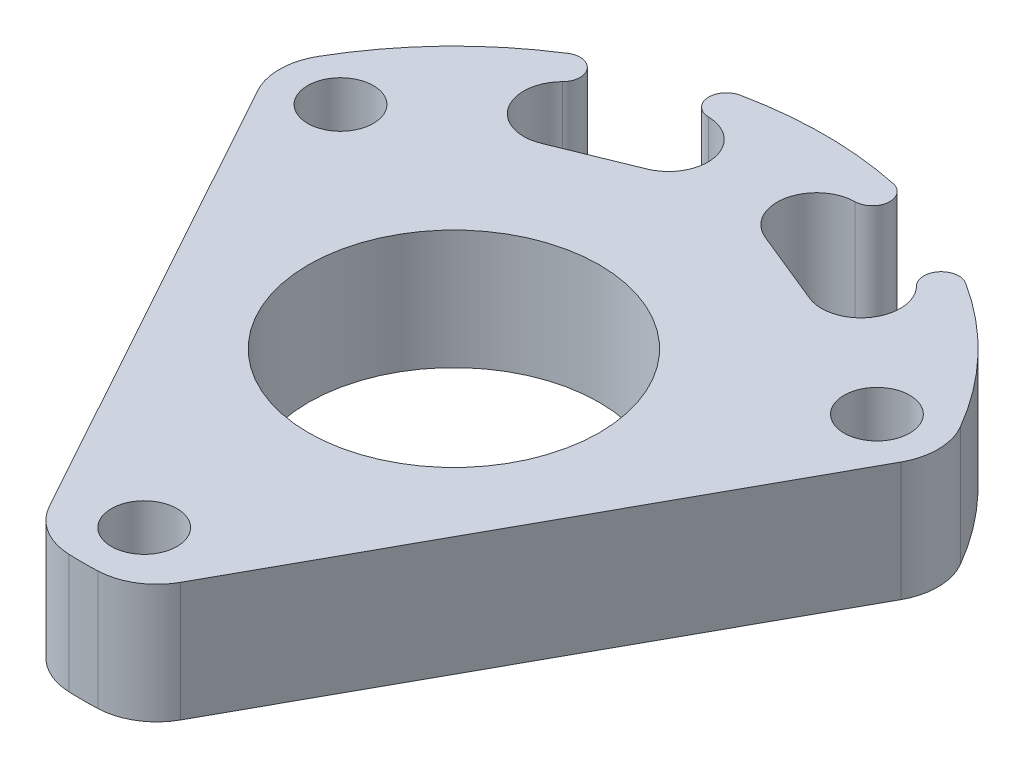
ISO-10303-21;
HEADER;
FILE_DESCRIPTION(('STEP AP214'),'2;1');
FILE_NAME('part.step','',(''),(''),'','','');
FILE_SCHEMA(('AUTOMOTIVE_DESIGN { 1 0 10303 214 1 1 1 1 }'));
ENDSEC;
DATA;
#1=APPLICATION_CONTEXT('core data for automotive mechanical design processes');
#2=APPLICATION_PROTOCOL_DEFINITION('international standard','automotive_design',2000,#1);
#3=PRODUCT_CONTEXT('',#1,'mechanical');
#4=PRODUCT('Part','Part','',(#3));
#5=PRODUCT_RELATED_PRODUCT_CATEGORY('part','',(#4));
#6=PRODUCT_DEFINITION_FORMATION('','',#4);
#7=PRODUCT_DEFINITION_CONTEXT('part definition',#1,'design');
#8=PRODUCT_DEFINITION('design','',#6,#7);
#9=PRODUCT_DEFINITION_SHAPE('','',#8);
#10=(LENGTH_UNIT() NAMED_UNIT(*) SI_UNIT(.MILLI.,.METRE.));
#11=(NAMED_UNIT(*) PLANE_ANGLE_UNIT() SI_UNIT($,.RADIAN.));
#12=(NAMED_UNIT(*) SI_UNIT($,.STERADIAN.) SOLID_ANGLE_UNIT());
#13=UNCERTAINTY_MEASURE_WITH_UNIT(LENGTH_MEASURE(1.E-05),#10,'distance_accuracy_value','');
#14=(GEOMETRIC_REPRESENTATION_CONTEXT(3) GLOBAL_UNCERTAINTY_ASSIGNED_CONTEXT((#13)) GLOBAL_UNIT_ASSIGNED_CONTEXT((#10,
#11,#12)) REPRESENTATION_CONTEXT('',''));
#15=CARTESIAN_POINT('',(0.,0.,0.));
#16=DIRECTION('',(0.,0.,1.));
#17=DIRECTION('',(1.,0.,0.));
#18=AXIS2_PLACEMENT_3D('',#15,#16,#17);
#19=CARTESIAN_POINT('',(0.,6.35,0.));
#20=DIRECTION('',(0.,-1.,0.));
#21=DIRECTION('',(0.,0.,-1.));
#22=AXIS2_PLACEMENT_3D('',#19,#20,#21);
#23=CYLINDRICAL_SURFACE('',#22,19.75);
#24=DIRECTION('',(0.,1.,0.));
#25=VECTOR('',#24,1.);
#26=CARTESIAN_POINT('',(-10.59217230935,0.,-16.6693846847758));
#27=LINE('',#26,#25);
#28=CARTESIAN_POINT('',(-10.59217230935,0.,-16.6693846847758));
#29=VERTEX_POINT('',#28);
#30=CARTESIAN_POINT('',(-10.59217230935,6.35,-16.6693846847758));
#31=VERTEX_POINT('',#30);
#32=EDGE_CURVE('E211',#29,#31,#27,.T.);
#33=ORIENTED_EDGE('',*,*,#32,.F.);
#34=CARTESIAN_POINT('',(0.,0.,0.));
#35=DIRECTION('',(0.,1.,0.));
#36=DIRECTION('',(0.,0.,1.));
#37=AXIS2_PLACEMENT_3D('',#34,#35,#36);
#38=CIRCLE('',#37,19.75);
#39=CARTESIAN_POINT('',(-17.1040017247427,0.,-9.875));
#40=VERTEX_POINT('',#39);
#41=EDGE_CURVE('E192',#29,#40,#38,.T.);
#42=ORIENTED_EDGE('',*,*,#41,.T.);
#43=DIRECTION('',(0.,-1.,0.));
#44=VECTOR('',#43,1.);
#45=CARTESIAN_POINT('',(-17.1040017247427,6.35,-9.875));
#46=LINE('',#45,#44);
#47=CARTESIAN_POINT('',(-17.1040017247427,6.35,-9.875));
#48=VERTEX_POINT('',#47);
#49=EDGE_CURVE('E11',#48,#40,#46,.T.);
#50=ORIENTED_EDGE('',*,*,#49,.F.);
#51=CARTESIAN_POINT('',(0.,6.35,0.));
#52=DIRECTION('',(0.,1.,0.));
#53=DIRECTION('',(0.,0.,1.));
#54=AXIS2_PLACEMENT_3D('',#51,#52,#53);
#55=CIRCLE('',#54,19.75);
#56=EDGE_CURVE('E290',#31,#48,#55,.T.);
#57=ORIENTED_EDGE('',*,*,#56,.F.);
#58=EDGE_LOOP('',(#33,#42,#50,#57));
#59=FACE_BOUND('',#58,.T.);
#60=ADVANCED_FACE('F35',(#59),#23,.T.);
#61=CARTESIAN_POINT('',(0.,6.35,0.));
#62=DIRECTION('',(0.,1.,0.));
#63=DIRECTION('',(0.,0.,1.));
#64=AXIS2_PLACEMENT_3D('',#61,#62,#63);
#65=PLANE('',#64);
#66=CARTESIAN_POINT('',(14.2894191624432,6.35,-8.25));
#67=DIRECTION('',(0.,1.,0.));
#68=DIRECTION('',(0.,0.,1.));
#69=AXIS2_PLACEMENT_3D('',#66,#67,#68);
#70=CIRCLE('',#69,1.75);
#71=CARTESIAN_POINT('',(14.2894191624432,6.35,-6.5));
#72=VERTEX_POINT('',#71);
#73=EDGE_CURVE('E262',#72,#72,#70,.T.);
#74=ORIENTED_EDGE('',*,*,#73,.F.);
#75=EDGE_LOOP('',(#74));
#76=FACE_BOUND('',#75,.T.);
#77=CARTESIAN_POINT('',(-14.2894191624432,6.35,-8.25));
#78=DIRECTION('',(0.,1.,0.));
#79=DIRECTION('',(0.,0.,1.));
#80=AXIS2_PLACEMENT_3D('',#77,#78,#79);
#81=CIRCLE('',#80,1.75);
#82=CARTESIAN_POINT('',(-14.2894191624432,6.35,-6.5));
#83=VERTEX_POINT('',#82);
#84=EDGE_CURVE('E274',#83,#83,#81,.T.);
#85=ORIENTED_EDGE('',*,*,#84,.F.);
#86=EDGE_LOOP('',(#85));
#87=FACE_BOUND('',#86,.T.);
#88=CARTESIAN_POINT('',(0.,6.35,0.));
#89=DIRECTION('',(0.,1.,0.));
#90=DIRECTION('',(0.,0.,1.));
#91=AXIS2_PLACEMENT_3D('',#88,#89,#90);
#92=CIRCLE('',#91,7.75);
#93=CARTESIAN_POINT('',(0.,6.35,7.75));
#94=VERTEX_POINT('',#93);
#95=EDGE_CURVE('E280',#94,#94,#92,.T.);
#96=ORIENTED_EDGE('',*,*,#95,.F.);
#97=EDGE_LOOP('',(#96));
#98=FACE_BOUND('',#97,.T.);
#99=CARTESIAN_POINT('',(0.,6.35,16.5));
#100=DIRECTION('',(0.,1.,0.));
#101=DIRECTION('',(0.,0.,1.));
#102=AXIS2_PLACEMENT_3D('',#99,#100,#101);
#103=CIRCLE('',#102,1.75);
#104=CARTESIAN_POINT('',(0.,6.35,18.25));
#105=VERTEX_POINT('',#104);
#106=EDGE_CURVE('E268',#105,#105,#103,.T.);
#107=ORIENTED_EDGE('',*,*,#106,.F.);
#108=EDGE_LOOP('',(#107));
#109=FACE_BOUND('',#108,.T.);
#110=CARTESIAN_POINT('',(-7.9375,6.35,-13.748153285078));
#111=DIRECTION('',(0.,-1.,0.));
#112=DIRECTION('',(0.,0.,1.));
#113=AXIS2_PLACEMENT_3D('',#110,#111,#112);
#114=CIRCLE('',#113,2.0955);
#115=CARTESIAN_POINT('',(-7.14629166365357,6.35,-11.8077642471539));
#116=VERTEX_POINT('',#115);
#117=CARTESIAN_POINT('',(-9.42651956874446,6.35,-15.222582318262));
#118=VERTEX_POINT('',#117);
#119=EDGE_CURVE('E204',#116,#118,#114,.T.);
#120=ORIENTED_EDGE('',*,*,#119,.T.);
#121=CARTESIAN_POINT('',(-10.0908024265823,6.35,-15.8803560321887));
#122=DIRECTION('',(0.,1.,0.));
#123=DIRECTION('',(0.,0.,1.));
#124=AXIS2_PLACEMENT_3D('',#121,#122,#123);
#125=CIRCLE('',#124,0.934846497533168);
#126=EDGE_CURVE('E185',#118,#31,#125,.T.);
#127=ORIENTED_EDGE('',*,*,#126,.T.);
#128=ORIENTED_EDGE('',*,*,#56,.T.);
#129=CARTESIAN_POINT('',(-14.2894191624432,6.35,-8.25));
#130=DIRECTION('',(0.,1.,0.));
#131=DIRECTION('',(0.,0.,1.));
#132=AXIS2_PLACEMENT_3D('',#129,#130,#131);
#133=CIRCLE('',#132,3.25);
#134=CARTESIAN_POINT('',(-17.1356486787678,6.35,-6.68109033389337));
#135=VERTEX_POINT('',#134);
#136=EDGE_CURVE('E288',#48,#135,#133,.T.);
#137=ORIENTED_EDGE('',*,*,#136,.T.);
#138=DIRECTION('',(0.482741435725117,0.,0.875762928099867));
#139=VECTOR('',#138,1.);
#140=CARTESIAN_POINT('',(-17.1356486787678,6.35,-6.68109033389337));
#141=LINE('',#140,#139);
#142=CARTESIAN_POINT('',(-3.5,6.35,18.0559525833394));
#143=VERTEX_POINT('',#142);
#144=EDGE_CURVE('E292',#135,#143,#141,.T.);
#145=ORIENTED_EDGE('',*,*,#144,.T.);
#146=CARTESIAN_POINT('',(-0.65377048367543,6.35,16.4870429172328));
#147=DIRECTION('',(0.,1.,0.));
#148=DIRECTION('',(0.,0.,-1.));
#149=AXIS2_PLACEMENT_3D('',#146,#147,#148);
#150=CIRCLE('',#149,3.25);
#151=CARTESIAN_POINT('',(-0.782543457732722,6.35,19.7344907645665));
#152=VERTEX_POINT('',#151);
#153=EDGE_CURVE('E294',#143,#152,#150,.T.);
#154=ORIENTED_EDGE('',*,*,#153,.T.);
#155=CARTESIAN_POINT('',(0.,6.35,0.));
#156=DIRECTION('',(0.,1.,0.));
#157=DIRECTION('',(0.,0.,1.));
#158=AXIS2_PLACEMENT_3D('',#155,#156,#157);
#159=CIRCLE('',#158,19.75);
#160=CARTESIAN_POINT('',(0.782543457732719,6.35,19.7344907645665));
#161=VERTEX_POINT('',#160);
#162=EDGE_CURVE('E296',#152,#161,#159,.T.);
#163=ORIENTED_EDGE('',*,*,#162,.T.);
#164=CARTESIAN_POINT('',(0.653770483675436,6.35,16.4870429172328));
#165=DIRECTION('',(0.,1.,0.));
#166=DIRECTION('',(0.,0.,-1.));
#167=AXIS2_PLACEMENT_3D('',#164,#165,#166);
#168=CIRCLE('',#167,3.25);
#169=CARTESIAN_POINT('',(3.5,6.35,18.0559525833394));
#170=VERTEX_POINT('',#169);
#171=EDGE_CURVE('E298',#161,#170,#168,.T.);
#172=ORIENTED_EDGE('',*,*,#171,.T.);
#173=DIRECTION('',(0.482741435725117,0.,-0.875762928099867));
#174=VECTOR('',#173,1.);
#175=CARTESIAN_POINT('',(3.5,6.35,18.0559525833394));
#176=LINE('',#175,#174);
#177=CARTESIAN_POINT('',(17.1356486787678,6.35,-6.68109033389337));
#178=VERTEX_POINT('',#177);
#179=EDGE_CURVE('E300',#170,#178,#176,.T.);
#180=ORIENTED_EDGE('',*,*,#179,.T.);
#181=CARTESIAN_POINT('',(14.2894191624432,6.35,-8.25));
#182=DIRECTION('',(0.,1.,0.));
#183=DIRECTION('',(0.,0.,1.));
#184=AXIS2_PLACEMENT_3D('',#181,#182,#183);
#185=CIRCLE('',#184,3.25);
#186=CARTESIAN_POINT('',(17.1040017247427,6.35,-9.875));
#187=VERTEX_POINT('',#186);
#188=EDGE_CURVE('E302',#178,#187,#185,.T.);
#189=ORIENTED_EDGE('',*,*,#188,.T.);
#190=CARTESIAN_POINT('',(10.59217230935,6.35,-16.6693846847758));
#191=VERTEX_POINT('',#190);
#192=EDGE_CURVE('E285',#187,#191,#55,.T.);
#193=ORIENTED_EDGE('',*,*,#192,.T.);
#194=CARTESIAN_POINT('',(10.0908024265823,6.35,-15.8803560321887));
#195=DIRECTION('',(0.,-1.,0.));
#196=DIRECTION('',(0.,0.,1.));
#197=AXIS2_PLACEMENT_3D('',#194,#195,#196);
#198=CIRCLE('',#197,0.934846497533168);
#199=CARTESIAN_POINT('',(9.42651956874446,6.35,-15.222582318262));
#200=VERTEX_POINT('',#199);
#201=EDGE_CURVE('E213',#200,#191,#198,.T.);
#202=ORIENTED_EDGE('',*,*,#201,.F.);
#203=CARTESIAN_POINT('',(7.9375,6.35,-13.748153285078));
#204=DIRECTION('',(0.,1.,0.));
#205=DIRECTION('',(0.,0.,1.));
#206=AXIS2_PLACEMENT_3D('',#203,#204,#205);
#207=CIRCLE('',#206,2.0955);
#208=CARTESIAN_POINT('',(7.14629166365357,6.35,-11.8077642471539));
#209=VERTEX_POINT('',#208);
#210=EDGE_CURVE('E225',#209,#200,#207,.T.);
#211=ORIENTED_EDGE('',*,*,#210,.F.);
#212=DIRECTION('',(0.925979020722535,0.,0.377574963658523));
#213=VECTOR('',#212,1.);
#214=CARTESIAN_POINT('',(3.14791425217366,6.35,-13.4381329402314));
#215=LINE('',#214,#213);
#216=CARTESIAN_POINT('',(3.14791425217366,6.35,-13.4381329402314));
#217=VERTEX_POINT('',#216);
#218=EDGE_CURVE('E244',#217,#209,#215,.T.);
#219=ORIENTED_EDGE('',*,*,#218,.F.);
#220=CARTESIAN_POINT('',(3.9391225885201,6.35,-15.3785219781555));
#221=DIRECTION('',(0.,1.,0.));
#222=DIRECTION('',(0.,0.,1.));
#223=AXIS2_PLACEMENT_3D('',#220,#221,#222);
#224=CIRCLE('',#223,2.0955);
#225=CARTESIAN_POINT('',(3.90565968638828,6.35,-17.4737547776746));
#226=VERTEX_POINT('',#225);
#227=EDGE_CURVE('E241',#226,#217,#224,.T.);
#228=ORIENTED_EDGE('',*,*,#227,.F.);
#229=CARTESIAN_POINT('',(3.89073118395201,6.35,-18.4084820714695));
#230=DIRECTION('',(0.,-1.,0.));
#231=DIRECTION('',(0.,0.,1.));
#232=AXIS2_PLACEMENT_3D('',#229,#230,#231);
#233=CIRCLE('',#232,0.934846497533166);
#234=CARTESIAN_POINT('',(4.08404538782941,6.35,-19.3231227618661));
#235=VERTEX_POINT('',#234);
#236=EDGE_CURVE('E238',#235,#226,#233,.T.);
#237=ORIENTED_EDGE('',*,*,#236,.F.);
#238=CARTESIAN_POINT('',(-4.08404538782941,6.35,-19.3231227618661));
#239=VERTEX_POINT('',#238);
#240=EDGE_CURVE('E289',#235,#239,#55,.T.);
#241=ORIENTED_EDGE('',*,*,#240,.T.);
#242=CARTESIAN_POINT('',(-3.89073118395201,6.35,-18.4084820714695));
#243=DIRECTION('',(0.,1.,0.));
#244=DIRECTION('',(0.,0.,1.));
#245=AXIS2_PLACEMENT_3D('',#242,#243,#244);
#246=CIRCLE('',#245,0.934846497533166);
#247=CARTESIAN_POINT('',(-3.90565968638828,6.35,-17.4737547776746));
#248=VERTEX_POINT('',#247);
#249=EDGE_CURVE('E193',#239,#248,#246,.T.);
#250=ORIENTED_EDGE('',*,*,#249,.T.);
#251=CARTESIAN_POINT('',(-3.9391225885201,6.35,-15.3785219781555));
#252=DIRECTION('',(0.,-1.,0.));
#253=DIRECTION('',(0.,0.,1.));
#254=AXIS2_PLACEMENT_3D('',#251,#252,#253);
#255=CIRCLE('',#254,2.0955);
#256=CARTESIAN_POINT('',(-3.14791425217366,6.35,-13.4381329402314));
#257=VERTEX_POINT('',#256);
#258=EDGE_CURVE('E196',#248,#257,#255,.T.);
#259=ORIENTED_EDGE('',*,*,#258,.T.);
#260=DIRECTION('',(-0.925979020722535,0.,0.377574963658523));
#261=VECTOR('',#260,1.);
#262=CARTESIAN_POINT('',(-3.14791425217366,6.35,-13.4381329402314));
#263=LINE('',#262,#261);
#264=EDGE_CURVE('E206',#257,#116,#263,.T.);
#265=ORIENTED_EDGE('',*,*,#264,.T.);
#266=EDGE_LOOP('',(#120,#127,#128,#137,#145,#154,#163,#172,#180,#189,#193,#202,#211,#219,#228,
#237,#241,#250,#259,#265));
#267=FACE_BOUND('',#266,.T.);
#268=ADVANCED_FACE('F361',(#76,#87,#98,#109,#267),#65,.T.);
#269=CARTESIAN_POINT('',(0.,0.,0.));
#270=DIRECTION('',(0.,1.,0.));
#271=DIRECTION('',(0.,0.,1.));
#272=AXIS2_PLACEMENT_3D('',#269,#270,#271);
#273=PLANE('',#272);
#274=CARTESIAN_POINT('',(14.2894191624432,0.,-8.25));
#275=DIRECTION('',(0.,1.,0.));
#276=DIRECTION('',(0.,0.,1.));
#277=AXIS2_PLACEMENT_3D('',#274,#275,#276);
#278=CIRCLE('',#277,1.75);
#279=CARTESIAN_POINT('',(14.2894191624432,0.,-6.5));
#280=VERTEX_POINT('',#279);
#281=EDGE_CURVE('E251',#280,#280,#278,.T.);
#282=ORIENTED_EDGE('',*,*,#281,.T.);
#283=EDGE_LOOP('',(#282));
#284=FACE_BOUND('',#283,.T.);
#285=CARTESIAN_POINT('',(-14.2894191624432,0.,-8.25));
#286=DIRECTION('',(0.,1.,0.));
#287=DIRECTION('',(0.,0.,1.));
#288=AXIS2_PLACEMENT_3D('',#285,#286,#287);
#289=CIRCLE('',#288,1.75);
#290=CARTESIAN_POINT('',(-14.2894191624432,0.,-6.5));
#291=VERTEX_POINT('',#290);
#292=EDGE_CURVE('E271',#291,#291,#289,.T.);
#293=ORIENTED_EDGE('',*,*,#292,.T.);
#294=EDGE_LOOP('',(#293));
#295=FACE_BOUND('',#294,.T.);
#296=CARTESIAN_POINT('',(0.,0.,0.));
#297=DIRECTION('',(0.,1.,0.));
#298=DIRECTION('',(0.,0.,1.));
#299=AXIS2_PLACEMENT_3D('',#296,#297,#298);
#300=CIRCLE('',#299,7.75);
#301=CARTESIAN_POINT('',(0.,0.,7.75));
#302=VERTEX_POINT('',#301);
#303=EDGE_CURVE('E277',#302,#302,#300,.T.);
#304=ORIENTED_EDGE('',*,*,#303,.T.);
#305=EDGE_LOOP('',(#304));
#306=FACE_BOUND('',#305,.T.);
#307=CARTESIAN_POINT('',(0.,0.,16.5));
#308=DIRECTION('',(0.,1.,0.));
#309=DIRECTION('',(0.,0.,1.));
#310=AXIS2_PLACEMENT_3D('',#307,#308,#309);
#311=CIRCLE('',#310,1.75);
#312=CARTESIAN_POINT('',(0.,0.,18.25));
#313=VERTEX_POINT('',#312);
#314=EDGE_CURVE('E265',#313,#313,#311,.T.);
#315=ORIENTED_EDGE('',*,*,#314,.T.);
#316=EDGE_LOOP('',(#315));
#317=FACE_BOUND('',#316,.T.);
#318=CARTESIAN_POINT('',(-10.0908024265823,0.,-15.8803560321887));
#319=DIRECTION('',(0.,1.,0.));
#320=DIRECTION('',(0.,0.,1.));
#321=AXIS2_PLACEMENT_3D('',#318,#319,#320);
#322=CIRCLE('',#321,0.934846497533168);
#323=CARTESIAN_POINT('',(-9.42651956874446,0.,-15.222582318262));
#324=VERTEX_POINT('',#323);
#325=EDGE_CURVE('E179',#324,#29,#322,.T.);
#326=ORIENTED_EDGE('',*,*,#325,.F.);
#327=CARTESIAN_POINT('',(-7.9375,0.,-13.748153285078));
#328=DIRECTION('',(0.,-1.,0.));
#329=DIRECTION('',(0.,0.,1.));
#330=AXIS2_PLACEMENT_3D('',#327,#328,#329);
#331=CIRCLE('',#330,2.0955);
#332=CARTESIAN_POINT('',(-7.14629166365356,0.,-11.8077642471539));
#333=VERTEX_POINT('',#332);
#334=EDGE_CURVE('E170',#333,#324,#331,.T.);
#335=ORIENTED_EDGE('',*,*,#334,.F.);
#336=DIRECTION('',(-0.925979020722535,0.,0.377574963658523));
#337=VECTOR('',#336,1.);
#338=CARTESIAN_POINT('',(-3.14791425217366,0.,-13.4381329402314));
#339=LINE('',#338,#337);
#340=CARTESIAN_POINT('',(-3.14791425217366,0.,-13.4381329402314));
#341=VERTEX_POINT('',#340);
#342=EDGE_CURVE('E178',#341,#333,#339,.T.);
#343=ORIENTED_EDGE('',*,*,#342,.F.);
#344=CARTESIAN_POINT('',(-3.9391225885201,0.,-15.3785219781555));
#345=DIRECTION('',(0.,-1.,0.));
#346=DIRECTION('',(0.,0.,1.));
#347=AXIS2_PLACEMENT_3D('',#344,#345,#346);
#348=CIRCLE('',#347,2.0955);
#349=CARTESIAN_POINT('',(-3.90565968638828,0.,-17.4737547776746));
#350=VERTEX_POINT('',#349);
#351=EDGE_CURVE('E200',#350,#341,#348,.T.);
#352=ORIENTED_EDGE('',*,*,#351,.F.);
#353=CARTESIAN_POINT('',(-3.89073118395201,0.,-18.4084820714695));
#354=DIRECTION('',(0.,1.,0.));
#355=DIRECTION('',(0.,0.,1.));
#356=AXIS2_PLACEMENT_3D('',#353,#354,#355);
#357=CIRCLE('',#356,0.934846497533166);
#358=CARTESIAN_POINT('',(-4.08404538782941,0.,-19.3231227618661));
#359=VERTEX_POINT('',#358);
#360=EDGE_CURVE('E187',#359,#350,#357,.T.);
#361=ORIENTED_EDGE('',*,*,#360,.F.);
#362=CARTESIAN_POINT('',(4.08404538782941,0.,-19.3231227618661));
#363=VERTEX_POINT('',#362);
#364=EDGE_CURVE('E309',#363,#359,#38,.T.);
#365=ORIENTED_EDGE('',*,*,#364,.F.);
#366=CARTESIAN_POINT('',(3.89073118395201,0.,-18.4084820714695));
#367=DIRECTION('',(0.,-1.,0.));
#368=DIRECTION('',(0.,0.,1.));
#369=AXIS2_PLACEMENT_3D('',#366,#367,#368);
#370=CIRCLE('',#369,0.934846497533166);
#371=CARTESIAN_POINT('',(3.90565968638828,0.,-17.4737547776746));
#372=VERTEX_POINT('',#371);
#373=EDGE_CURVE('E58',#363,#372,#370,.T.);
#374=ORIENTED_EDGE('',*,*,#373,.T.);
#375=CARTESIAN_POINT('',(3.9391225885201,0.,-15.3785219781555));
#376=DIRECTION('',(0.,1.,0.));
#377=DIRECTION('',(0.,0.,1.));
#378=AXIS2_PLACEMENT_3D('',#375,#376,#377);
#379=CIRCLE('',#378,2.0955);
#380=CARTESIAN_POINT('',(3.14791425217366,0.,-13.4381329402314));
#381=VERTEX_POINT('',#380);
#382=EDGE_CURVE('E227',#372,#381,#379,.T.);
#383=ORIENTED_EDGE('',*,*,#382,.T.);
#384=DIRECTION('',(0.925979020722535,0.,0.377574963658523));
#385=VECTOR('',#384,1.);
#386=CARTESIAN_POINT('',(3.14791425217366,0.,-13.4381329402314));
#387=LINE('',#386,#385);
#388=CARTESIAN_POINT('',(7.14629166365357,0.,-11.8077642471539));
#389=VERTEX_POINT('',#388);
#390=EDGE_CURVE('E230',#381,#389,#387,.T.);
#391=ORIENTED_EDGE('',*,*,#390,.T.);
#392=CARTESIAN_POINT('',(7.9375,0.,-13.748153285078));
#393=DIRECTION('',(0.,1.,0.));
#394=DIRECTION('',(0.,0.,1.));
#395=AXIS2_PLACEMENT_3D('',#392,#393,#394);
#396=CIRCLE('',#395,2.0955);
#397=CARTESIAN_POINT('',(9.42651956874446,0.,-15.222582318262));
#398=VERTEX_POINT('',#397);
#399=EDGE_CURVE('E233',#389,#398,#396,.T.);
#400=ORIENTED_EDGE('',*,*,#399,.T.);
#401=CARTESIAN_POINT('',(10.0908024265823,0.,-15.8803560321887));
#402=DIRECTION('',(0.,-1.,0.));
#403=DIRECTION('',(0.,0.,1.));
#404=AXIS2_PLACEMENT_3D('',#401,#402,#403);
#405=CIRCLE('',#404,0.934846497533168);
#406=CARTESIAN_POINT('',(10.59217230935,0.,-16.6693846847758));
#407=VERTEX_POINT('',#406);
#408=EDGE_CURVE('E222',#398,#407,#405,.T.);
#409=ORIENTED_EDGE('',*,*,#408,.T.);
#410=CARTESIAN_POINT('',(17.1040017247427,0.,-9.875));
#411=VERTEX_POINT('',#410);
#412=EDGE_CURVE('E305',#411,#407,#38,.T.);
#413=ORIENTED_EDGE('',*,*,#412,.F.);
#414=CARTESIAN_POINT('',(14.2894191624432,0.,-8.25));
#415=DIRECTION('',(0.,1.,0.));
#416=DIRECTION('',(0.,0.,1.));
#417=AXIS2_PLACEMENT_3D('',#414,#415,#416);
#418=CIRCLE('',#417,3.25);
#419=CARTESIAN_POINT('',(17.1356486787678,0.,-6.68109033389337));
#420=VERTEX_POINT('',#419);
#421=EDGE_CURVE('E321',#420,#411,#418,.T.);
#422=ORIENTED_EDGE('',*,*,#421,.F.);
#423=DIRECTION('',(0.482741435725117,0.,-0.875762928099867));
#424=VECTOR('',#423,1.);
#425=CARTESIAN_POINT('',(3.5,0.,18.0559525833394));
#426=LINE('',#425,#424);
#427=CARTESIAN_POINT('',(3.5,0.,18.0559525833394));
#428=VERTEX_POINT('',#427);
#429=EDGE_CURVE('E319',#428,#420,#426,.T.);
#430=ORIENTED_EDGE('',*,*,#429,.F.);
#431=CARTESIAN_POINT('',(0.653770483675436,0.,16.4870429172328));
#432=DIRECTION('',(0.,1.,0.));
#433=DIRECTION('',(0.,0.,-1.));
#434=AXIS2_PLACEMENT_3D('',#431,#432,#433);
#435=CIRCLE('',#434,3.25);
#436=CARTESIAN_POINT('',(0.782543457732719,0.,19.7344907645665));
#437=VERTEX_POINT('',#436);
#438=EDGE_CURVE('E317',#437,#428,#435,.T.);
#439=ORIENTED_EDGE('',*,*,#438,.F.);
#440=CARTESIAN_POINT('',(0.,0.,0.));
#441=DIRECTION('',(0.,1.,0.));
#442=DIRECTION('',(0.,0.,1.));
#443=AXIS2_PLACEMENT_3D('',#440,#441,#442);
#444=CIRCLE('',#443,19.75);
#445=CARTESIAN_POINT('',(-0.782543457732722,0.,19.7344907645665));
#446=VERTEX_POINT('',#445);
#447=EDGE_CURVE('E315',#446,#437,#444,.T.);
#448=ORIENTED_EDGE('',*,*,#447,.F.);
#449=CARTESIAN_POINT('',(-0.65377048367543,0.,16.4870429172328));
#450=DIRECTION('',(0.,1.,0.));
#451=DIRECTION('',(0.,0.,-1.));
#452=AXIS2_PLACEMENT_3D('',#449,#450,#451);
#453=CIRCLE('',#452,3.25);
#454=CARTESIAN_POINT('',(-3.5,0.,18.0559525833394));
#455=VERTEX_POINT('',#454);
#456=EDGE_CURVE('E313',#455,#446,#453,.T.);
#457=ORIENTED_EDGE('',*,*,#456,.F.);
#458=DIRECTION('',(0.482741435725117,0.,0.875762928099867));
#459=VECTOR('',#458,1.);
#460=CARTESIAN_POINT('',(-17.1356486787678,0.,-6.68109033389337));
#461=LINE('',#460,#459);
#462=CARTESIAN_POINT('',(-17.1356486787678,0.,-6.68109033389337));
#463=VERTEX_POINT('',#462);
#464=EDGE_CURVE('E311',#463,#455,#461,.T.);
#465=ORIENTED_EDGE('',*,*,#464,.F.);
#466=CARTESIAN_POINT('',(-14.2894191624432,0.,-8.25));
#467=DIRECTION('',(0.,1.,0.));
#468=DIRECTION('',(0.,0.,1.));
#469=AXIS2_PLACEMENT_3D('',#466,#467,#468);
#470=CIRCLE('',#469,3.25);
#471=EDGE_CURVE('E308',#40,#463,#470,.T.);
#472=ORIENTED_EDGE('',*,*,#471,.F.);
#473=ORIENTED_EDGE('',*,*,#41,.F.);
#474=EDGE_LOOP('',(#326,#335,#343,#352,#361,#365,#374,#383,#391,#400,#409,#413,#422,#430,#439,
#448,#457,#465,#472,#473));
#475=FACE_BOUND('',#474,.T.);
#476=ADVANCED_FACE('F190',(#284,#295,#306,#317,#475),#273,.F.);
#477=ORIENTED_EDGE('',*,*,#364,.T.);
#478=DIRECTION('',(0.,1.,0.));
#479=VECTOR('',#478,1.);
#480=CARTESIAN_POINT('',(-4.08404538782941,0.,-19.3231227618661));
#481=LINE('',#480,#479);
#482=EDGE_CURVE('E214',#359,#239,#481,.T.);
#483=ORIENTED_EDGE('',*,*,#482,.T.);
#484=ORIENTED_EDGE('',*,*,#240,.F.);
#485=DIRECTION('',(0.,1.,0.));
#486=VECTOR('',#485,1.);
#487=CARTESIAN_POINT('',(4.08404538782941,0.,-19.3231227618661));
#488=LINE('',#487,#486);
#489=EDGE_CURVE('E258',#363,#235,#488,.T.);
#490=ORIENTED_EDGE('',*,*,#489,.F.);
#491=EDGE_LOOP('',(#477,#483,#484,#490));
#492=FACE_BOUND('',#491,.T.);
#493=ADVANCED_FACE('F370',(#492),#23,.T.);
#494=ORIENTED_EDGE('',*,*,#412,.T.);
#495=DIRECTION('',(0.,1.,0.));
#496=VECTOR('',#495,1.);
#497=CARTESIAN_POINT('',(10.59217230935,0.,-16.6693846847758));
#498=LINE('',#497,#496);
#499=EDGE_CURVE('E236',#407,#191,#498,.T.);
#500=ORIENTED_EDGE('',*,*,#499,.T.);
#501=ORIENTED_EDGE('',*,*,#192,.F.);
#502=DIRECTION('',(0.,-1.,0.));
#503=VECTOR('',#502,1.);
#504=CARTESIAN_POINT('',(17.1040017247427,6.35,-9.875));
#505=LINE('',#504,#503);
#506=EDGE_CURVE('E304',#187,#411,#505,.T.);
#507=ORIENTED_EDGE('',*,*,#506,.T.);
#508=EDGE_LOOP('',(#494,#500,#501,#507));
#509=FACE_BOUND('',#508,.T.);
#510=ADVANCED_FACE('F37',(#509),#23,.T.);
#511=CARTESIAN_POINT('',(-14.2894191624432,6.35,-8.25));
#512=DIRECTION('',(0.,-1.,0.));
#513=DIRECTION('',(0.,0.,-1.));
#514=AXIS2_PLACEMENT_3D('',#511,#512,#513);
#515=CYLINDRICAL_SURFACE('',#514,3.25);
#516=ORIENTED_EDGE('',*,*,#471,.T.);
#517=DIRECTION('',(0.,-1.,0.));
#518=VECTOR('',#517,1.);
#519=CARTESIAN_POINT('',(-17.1356486787678,6.35,-6.68109033389337));
#520=LINE('',#519,#518);
#521=EDGE_CURVE('E43',#135,#463,#520,.T.);
#522=ORIENTED_EDGE('',*,*,#521,.F.);
#523=ORIENTED_EDGE('',*,*,#136,.F.);
#524=ORIENTED_EDGE('',*,*,#49,.T.);
#525=EDGE_LOOP('',(#516,#522,#523,#524));
#526=FACE_BOUND('',#525,.T.);
#527=ADVANCED_FACE('F365',(#526),#515,.T.);
#528=CARTESIAN_POINT('',(-17.1356486787678,6.35,-6.68109033389337));
#529=DIRECTION('',(0.875762928099867,0.,-0.482741435725117));
#530=DIRECTION('',(-0.482741435725117,0.,-0.875762928099867));
#531=AXIS2_PLACEMENT_3D('',#528,#529,#530);
#532=PLANE('',#531);
#533=ORIENTED_EDGE('',*,*,#464,.T.);
#534=DIRECTION('',(0.,-1.,0.));
#535=VECTOR('',#534,1.);
#536=CARTESIAN_POINT('',(-3.5,6.35,18.0559525833394));
#537=LINE('',#536,#535);
#538=EDGE_CURVE('E337',#143,#455,#537,.T.);
#539=ORIENTED_EDGE('',*,*,#538,.F.);
#540=ORIENTED_EDGE('',*,*,#144,.F.);
#541=ORIENTED_EDGE('',*,*,#521,.T.);
#542=EDGE_LOOP('',(#533,#539,#540,#541));
#543=FACE_BOUND('',#542,.T.);
#544=ADVANCED_FACE('F344',(#543),#532,.F.);
#545=CARTESIAN_POINT('',(-0.65377048367543,6.35,16.4870429172328));
#546=DIRECTION('',(0.,-1.,0.));
#547=DIRECTION('',(0.,0.,-1.));
#548=AXIS2_PLACEMENT_3D('',#545,#546,#547);
#549=CYLINDRICAL_SURFACE('',#548,3.25);
#550=ORIENTED_EDGE('',*,*,#456,.T.);
#551=DIRECTION('',(0.,-1.,0.));
#552=VECTOR('',#551,1.);
#553=CARTESIAN_POINT('',(-0.782543457732722,6.35,19.7344907645665));
#554=LINE('',#553,#552);
#555=EDGE_CURVE('E334',#152,#446,#554,.T.);
#556=ORIENTED_EDGE('',*,*,#555,.F.);
#557=ORIENTED_EDGE('',*,*,#153,.F.);
#558=ORIENTED_EDGE('',*,*,#538,.T.);
#559=EDGE_LOOP('',(#550,#556,#557,#558));
#560=FACE_BOUND('',#559,.T.);
#561=ADVANCED_FACE('F353',(#560),#549,.T.);
#562=CARTESIAN_POINT('',(0.,6.35,0.));
#563=DIRECTION('',(0.,-1.,0.));
#564=DIRECTION('',(0.,0.,-1.));
#565=AXIS2_PLACEMENT_3D('',#562,#563,#564);
#566=CYLINDRICAL_SURFACE('',#565,19.75);
#567=ORIENTED_EDGE('',*,*,#447,.T.);
#568=DIRECTION('',(0.,-1.,0.));
#569=VECTOR('',#568,1.);
#570=CARTESIAN_POINT('',(0.782543457732719,6.35,19.7344907645665));
#571=LINE('',#570,#569);
#572=EDGE_CURVE('E331',#161,#437,#571,.T.);
#573=ORIENTED_EDGE('',*,*,#572,.F.);
#574=ORIENTED_EDGE('',*,*,#162,.F.);
#575=ORIENTED_EDGE('',*,*,#555,.T.);
#576=EDGE_LOOP('',(#567,#573,#574,#575));
#577=FACE_BOUND('',#576,.T.);
#578=ADVANCED_FACE('F357',(#577),#566,.T.);
#579=CARTESIAN_POINT('',(0.653770483675436,6.35,16.4870429172328));
#580=DIRECTION('',(0.,-1.,0.));
#581=DIRECTION('',(0.,0.,-1.));
#582=AXIS2_PLACEMENT_3D('',#579,#580,#581);
#583=CYLINDRICAL_SURFACE('',#582,3.25);
#584=ORIENTED_EDGE('',*,*,#438,.T.);
#585=DIRECTION('',(0.,-1.,0.));
#586=VECTOR('',#585,1.);
#587=CARTESIAN_POINT('',(3.5,6.35,18.0559525833394));
#588=LINE('',#587,#586);
#589=EDGE_CURVE('E328',#170,#428,#588,.T.);
#590=ORIENTED_EDGE('',*,*,#589,.F.);
#591=ORIENTED_EDGE('',*,*,#171,.F.);
#592=ORIENTED_EDGE('',*,*,#572,.T.);
#593=EDGE_LOOP('',(#584,#590,#591,#592));
#594=FACE_BOUND('',#593,.T.);
#595=ADVANCED_FACE('F415',(#594),#583,.T.);
#596=CARTESIAN_POINT('',(3.5,6.35,18.0559525833394));
#597=DIRECTION('',(-0.875762928099867,0.,-0.482741435725117));
#598=DIRECTION('',(-0.482741435725117,0.,0.875762928099867));
#599=AXIS2_PLACEMENT_3D('',#596,#597,#598);
#600=PLANE('',#599);
#601=ORIENTED_EDGE('',*,*,#429,.T.);
#602=DIRECTION('',(0.,-1.,0.));
#603=VECTOR('',#602,1.);
#604=CARTESIAN_POINT('',(17.1356486787678,6.35,-6.68109033389337));
#605=LINE('',#604,#603);
#606=EDGE_CURVE('E325',#178,#420,#605,.T.);
#607=ORIENTED_EDGE('',*,*,#606,.F.);
#608=ORIENTED_EDGE('',*,*,#179,.F.);
#609=ORIENTED_EDGE('',*,*,#589,.T.);
#610=EDGE_LOOP('',(#601,#607,#608,#609));
#611=FACE_BOUND('',#610,.T.);
#612=ADVANCED_FACE('F412',(#611),#600,.F.);
#613=CARTESIAN_POINT('',(14.2894191624432,6.35,-8.25));
#614=DIRECTION('',(0.,-1.,0.));
#615=DIRECTION('',(0.,0.,-1.));
#616=AXIS2_PLACEMENT_3D('',#613,#614,#615);
#617=CYLINDRICAL_SURFACE('',#616,3.25);
#618=ORIENTED_EDGE('',*,*,#421,.T.);
#619=ORIENTED_EDGE('',*,*,#506,.F.);
#620=ORIENTED_EDGE('',*,*,#188,.F.);
#621=ORIENTED_EDGE('',*,*,#606,.T.);
#622=EDGE_LOOP('',(#618,#619,#620,#621));
#623=FACE_BOUND('',#622,.T.);
#624=ADVANCED_FACE('F408',(#623),#617,.T.);
#625=CARTESIAN_POINT('',(0.,6.35,0.));
#626=DIRECTION('',(0.,-1.,0.));
#627=DIRECTION('',(0.,0.,-1.));
#628=AXIS2_PLACEMENT_3D('',#625,#626,#627);
#629=CYLINDRICAL_SURFACE('',#628,7.75);
#630=ORIENTED_EDGE('',*,*,#95,.T.);
#631=EDGE_LOOP('',(#630));
#632=FACE_BOUND('',#631,.T.);
#633=ORIENTED_EDGE('',*,*,#303,.F.);
#634=EDGE_LOOP('',(#633));
#635=FACE_BOUND('',#634,.T.);
#636=ADVANCED_FACE('F468',(#632,#635),#629,.F.);
#637=CARTESIAN_POINT('',(-14.2894191624432,6.35,-8.25));
#638=DIRECTION('',(0.,-1.,0.));
#639=DIRECTION('',(0.,0.,-1.));
#640=AXIS2_PLACEMENT_3D('',#637,#638,#639);
#641=CYLINDRICAL_SURFACE('',#640,1.75);
#642=ORIENTED_EDGE('',*,*,#84,.T.);
#643=EDGE_LOOP('',(#642));
#644=FACE_BOUND('',#643,.T.);
#645=ORIENTED_EDGE('',*,*,#292,.F.);
#646=EDGE_LOOP('',(#645));
#647=FACE_BOUND('',#646,.T.);
#648=ADVANCED_FACE('F477',(#644,#647),#641,.F.);
#649=CARTESIAN_POINT('',(0.,6.35,16.5));
#650=DIRECTION('',(0.,-1.,0.));
#651=DIRECTION('',(0.,0.,-1.));
#652=AXIS2_PLACEMENT_3D('',#649,#650,#651);
#653=CYLINDRICAL_SURFACE('',#652,1.75);
#654=ORIENTED_EDGE('',*,*,#106,.T.);
#655=EDGE_LOOP('',(#654));
#656=FACE_BOUND('',#655,.T.);
#657=ORIENTED_EDGE('',*,*,#314,.F.);
#658=EDGE_LOOP('',(#657));
#659=FACE_BOUND('',#658,.T.);
#660=ADVANCED_FACE('F487',(#656,#659),#653,.F.);
#661=CARTESIAN_POINT('',(14.2894191624432,6.35,-8.25));
#662=DIRECTION('',(0.,-1.,0.));
#663=DIRECTION('',(0.,0.,-1.));
#664=AXIS2_PLACEMENT_3D('',#661,#662,#663);
#665=CYLINDRICAL_SURFACE('',#664,1.75);
#666=ORIENTED_EDGE('',*,*,#73,.T.);
#667=EDGE_LOOP('',(#666));
#668=FACE_BOUND('',#667,.T.);
#669=ORIENTED_EDGE('',*,*,#281,.F.);
#670=EDGE_LOOP('',(#669));
#671=FACE_BOUND('',#670,.T.);
#672=ADVANCED_FACE('F497',(#668,#671),#665,.F.);
#673=CARTESIAN_POINT('',(10.0908024265823,0.,-15.8803560321887));
#674=DIRECTION('',(0.,1.,0.));
#675=DIRECTION('',(0.,0.,1.));
#676=AXIS2_PLACEMENT_3D('',#673,#674,#675);
#677=CYLINDRICAL_SURFACE('',#676,0.934846497533168);
#678=ORIENTED_EDGE('',*,*,#201,.T.);
#679=ORIENTED_EDGE('',*,*,#499,.F.);
#680=ORIENTED_EDGE('',*,*,#408,.F.);
#681=DIRECTION('',(0.,1.,0.));
#682=VECTOR('',#681,1.);
#683=CARTESIAN_POINT('',(9.42651956874446,0.,-15.222582318262));
#684=LINE('',#683,#682);
#685=EDGE_CURVE('E249',#398,#200,#684,.T.);
#686=ORIENTED_EDGE('',*,*,#685,.T.);
#687=EDGE_LOOP('',(#678,#679,#680,#686));
#688=FACE_BOUND('',#687,.T.);
#689=ADVANCED_FACE('F400',(#688),#677,.T.);
#690=CARTESIAN_POINT('',(7.9375,0.,-13.748153285078));
#691=DIRECTION('',(0.,1.,0.));
#692=DIRECTION('',(0.,0.,1.));
#693=AXIS2_PLACEMENT_3D('',#690,#691,#692);
#694=CYLINDRICAL_SURFACE('',#693,2.0955);
#695=ORIENTED_EDGE('',*,*,#210,.T.);
#696=ORIENTED_EDGE('',*,*,#685,.F.);
#697=ORIENTED_EDGE('',*,*,#399,.F.);
#698=DIRECTION('',(0.,1.,0.));
#699=VECTOR('',#698,1.);
#700=CARTESIAN_POINT('',(7.14629166365357,0.,-11.8077642471539));
#701=LINE('',#700,#699);
#702=EDGE_CURVE('E252',#389,#209,#701,.T.);
#703=ORIENTED_EDGE('',*,*,#702,.T.);
#704=EDGE_LOOP('',(#695,#696,#697,#703));
#705=FACE_BOUND('',#704,.T.);
#706=ADVANCED_FACE('F396',(#705),#694,.F.);
#707=CARTESIAN_POINT('',(3.14791425217366,0.,-13.4381329402314));
#708=DIRECTION('',(-0.377574963658523,0.,0.925979020722535));
#709=DIRECTION('',(0.925979020722535,0.,0.377574963658523));
#710=AXIS2_PLACEMENT_3D('',#707,#708,#709);
#711=PLANE('',#710);
#712=ORIENTED_EDGE('',*,*,#218,.T.);
#713=ORIENTED_EDGE('',*,*,#702,.F.);
#714=ORIENTED_EDGE('',*,*,#390,.F.);
#715=DIRECTION('',(0.,1.,0.));
#716=VECTOR('',#715,1.);
#717=CARTESIAN_POINT('',(3.14791425217366,0.,-13.4381329402314));
#718=LINE('',#717,#716);
#719=EDGE_CURVE('E254',#381,#217,#718,.T.);
#720=ORIENTED_EDGE('',*,*,#719,.T.);
#721=EDGE_LOOP('',(#712,#713,#714,#720));
#722=FACE_BOUND('',#721,.T.);
#723=ADVANCED_FACE('F393',(#722),#711,.F.);
#724=CARTESIAN_POINT('',(3.9391225885201,0.,-15.3785219781555));
#725=DIRECTION('',(0.,1.,0.));
#726=DIRECTION('',(0.,0.,1.));
#727=AXIS2_PLACEMENT_3D('',#724,#725,#726);
#728=CYLINDRICAL_SURFACE('',#727,2.0955);
#729=ORIENTED_EDGE('',*,*,#227,.T.);
#730=ORIENTED_EDGE('',*,*,#719,.F.);
#731=ORIENTED_EDGE('',*,*,#382,.F.);
#732=DIRECTION('',(0.,1.,0.));
#733=VECTOR('',#732,1.);
#734=CARTESIAN_POINT('',(3.90565968638828,0.,-17.4737547776746));
#735=LINE('',#734,#733);
#736=EDGE_CURVE('E256',#372,#226,#735,.T.);
#737=ORIENTED_EDGE('',*,*,#736,.T.);
#738=EDGE_LOOP('',(#729,#730,#731,#737));
#739=FACE_BOUND('',#738,.T.);
#740=ADVANCED_FACE('F389',(#739),#728,.F.);
#741=CARTESIAN_POINT('',(3.89073118395201,0.,-18.4084820714695));
#742=DIRECTION('',(0.,1.,0.));
#743=DIRECTION('',(0.,0.,1.));
#744=AXIS2_PLACEMENT_3D('',#741,#742,#743);
#745=CYLINDRICAL_SURFACE('',#744,0.934846497533166);
#746=ORIENTED_EDGE('',*,*,#236,.T.);
#747=ORIENTED_EDGE('',*,*,#736,.F.);
#748=ORIENTED_EDGE('',*,*,#373,.F.);
#749=ORIENTED_EDGE('',*,*,#489,.T.);
#750=EDGE_LOOP('',(#746,#747,#748,#749));
#751=FACE_BOUND('',#750,.T.);
#752=ADVANCED_FACE('F386',(#751),#745,.T.);
#753=CARTESIAN_POINT('',(-10.0908024265823,0.,-15.8803560321887));
#754=DIRECTION('',(0.,1.,0.));
#755=DIRECTION('',(0.,0.,1.));
#756=AXIS2_PLACEMENT_3D('',#753,#754,#755);
#757=CYLINDRICAL_SURFACE('',#756,0.934846497533168);
#758=ORIENTED_EDGE('',*,*,#126,.F.);
#759=DIRECTION('',(0.,1.,0.));
#760=VECTOR('',#759,1.);
#761=CARTESIAN_POINT('',(-9.42651956874446,0.,-15.222582318262));
#762=LINE('',#761,#760);
#763=EDGE_CURVE('E173',#324,#118,#762,.T.);
#764=ORIENTED_EDGE('',*,*,#763,.F.);
#765=ORIENTED_EDGE('',*,*,#325,.T.);
#766=ORIENTED_EDGE('',*,*,#32,.T.);
#767=EDGE_LOOP('',(#758,#764,#765,#766));
#768=FACE_BOUND('',#767,.T.);
#769=ADVANCED_FACE('F182',(#768),#757,.T.);
#770=CARTESIAN_POINT('',(-3.89073118395201,0.,-18.4084820714695));
#771=DIRECTION('',(0.,1.,0.));
#772=DIRECTION('',(0.,0.,1.));
#773=AXIS2_PLACEMENT_3D('',#770,#771,#772);
#774=CYLINDRICAL_SURFACE('',#773,0.934846497533166);
#775=ORIENTED_EDGE('',*,*,#249,.F.);
#776=ORIENTED_EDGE('',*,*,#482,.F.);
#777=ORIENTED_EDGE('',*,*,#360,.T.);
#778=DIRECTION('',(0.,1.,0.));
#779=VECTOR('',#778,1.);
#780=CARTESIAN_POINT('',(-3.90565968638828,0.,-17.4737547776746));
#781=LINE('',#780,#779);
#782=EDGE_CURVE('E217',#350,#248,#781,.T.);
#783=ORIENTED_EDGE('',*,*,#782,.T.);
#784=EDGE_LOOP('',(#775,#776,#777,#783));
#785=FACE_BOUND('',#784,.T.);
#786=ADVANCED_FACE('F377',(#785),#774,.T.);
#787=CARTESIAN_POINT('',(-3.9391225885201,0.,-15.3785219781555));
#788=DIRECTION('',(0.,1.,0.));
#789=DIRECTION('',(0.,0.,1.));
#790=AXIS2_PLACEMENT_3D('',#787,#788,#789);
#791=CYLINDRICAL_SURFACE('',#790,2.0955);
#792=ORIENTED_EDGE('',*,*,#258,.F.);
#793=ORIENTED_EDGE('',*,*,#782,.F.);
#794=ORIENTED_EDGE('',*,*,#351,.T.);
#795=DIRECTION('',(0.,1.,0.));
#796=VECTOR('',#795,1.);
#797=CARTESIAN_POINT('',(-3.14791425217366,0.,-13.4381329402314));
#798=LINE('',#797,#796);
#799=EDGE_CURVE('E219',#341,#257,#798,.T.);
#800=ORIENTED_EDGE('',*,*,#799,.T.);
#801=EDGE_LOOP('',(#792,#793,#794,#800));
#802=FACE_BOUND('',#801,.T.);
#803=ADVANCED_FACE('F380',(#802),#791,.F.);
#804=CARTESIAN_POINT('',(-3.14791425217366,0.,-13.4381329402314));
#805=DIRECTION('',(-0.377574963658523,0.,-0.925979020722535));
#806=DIRECTION('',(-0.925979020722535,0.,0.377574963658523));
#807=AXIS2_PLACEMENT_3D('',#804,#805,#806);
#808=PLANE('',#807);
#809=ORIENTED_EDGE('',*,*,#264,.F.);
#810=ORIENTED_EDGE('',*,*,#799,.F.);
#811=ORIENTED_EDGE('',*,*,#342,.T.);
#812=DIRECTION('',(0.,1.,0.));
#813=VECTOR('',#812,1.);
#814=CARTESIAN_POINT('',(-7.14629166365357,0.,-11.8077642471539));
#815=LINE('',#814,#813);
#816=EDGE_CURVE('E50',#333,#116,#815,.T.);
#817=ORIENTED_EDGE('',*,*,#816,.T.);
#818=EDGE_LOOP('',(#809,#810,#811,#817));
#819=FACE_BOUND('',#818,.T.);
#820=ADVANCED_FACE('F602',(#819),#808,.T.);
#821=CARTESIAN_POINT('',(-7.9375,0.,-13.748153285078));
#822=DIRECTION('',(0.,1.,0.));
#823=DIRECTION('',(0.,0.,1.));
#824=AXIS2_PLACEMENT_3D('',#821,#822,#823);
#825=CYLINDRICAL_SURFACE('',#824,2.0955);
#826=ORIENTED_EDGE('',*,*,#119,.F.);
#827=ORIENTED_EDGE('',*,*,#816,.F.);
#828=ORIENTED_EDGE('',*,*,#334,.T.);
#829=ORIENTED_EDGE('',*,*,#763,.T.);
#830=EDGE_LOOP('',(#826,#827,#828,#829));
#831=FACE_BOUND('',#830,.T.);
#832=ADVANCED_FACE('F172',(#831),#825,.F.);
#833=CLOSED_SHELL('',(#60,#268,#476,#493,#510,#527,#544,#561,#578,#595,#612,#624,#636,#648,#660,
#672,#689,#706,#723,#740,#752,#769,#786,#803,#820,#832));
#834=MANIFOLD_SOLID_BREP('B2',#833);
#835=ADVANCED_BREP_SHAPE_REPRESENTATION('',(#18,#834),#14);
#836=SHAPE_DEFINITION_REPRESENTATION(#9,#835);
ENDSEC;
END-ISO-10303-21;
